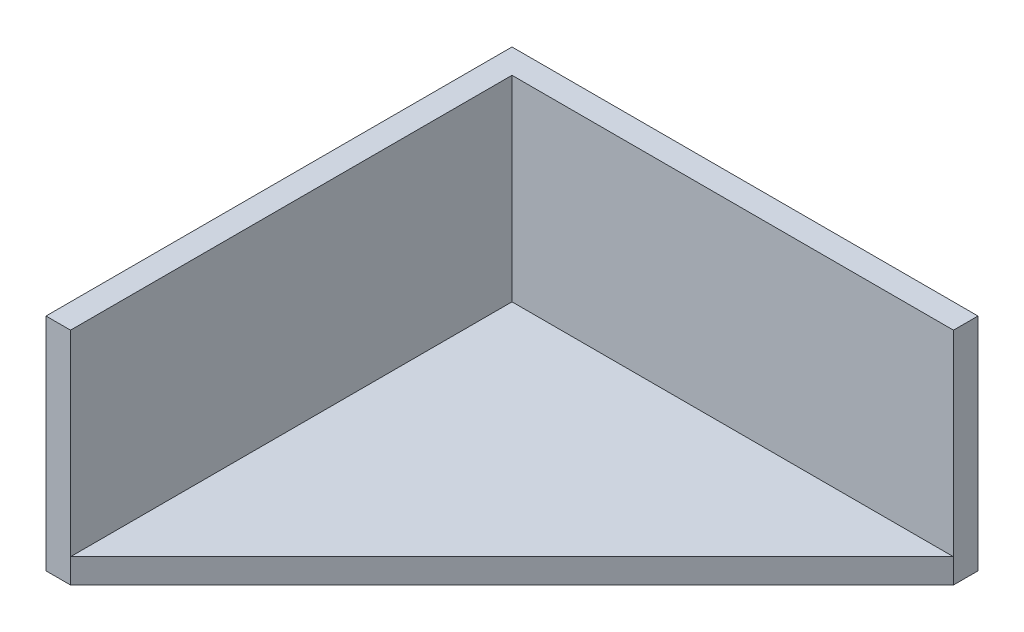
ISO-10303-21;
HEADER;
FILE_DESCRIPTION(('STEP AP214'),'2;1');
FILE_NAME('part.step','',(''),(''),'','','');
FILE_SCHEMA(('AUTOMOTIVE_DESIGN { 1 0 10303 214 1 1 1 1 }'));
ENDSEC;
DATA;
#1=APPLICATION_CONTEXT('core data for automotive mechanical design processes');
#2=APPLICATION_PROTOCOL_DEFINITION('international standard','automotive_design',2000,#1);
#3=PRODUCT_CONTEXT('',#1,'mechanical');
#4=PRODUCT('Part','Part','',(#3));
#5=PRODUCT_RELATED_PRODUCT_CATEGORY('part','',(#4));
#6=PRODUCT_DEFINITION_FORMATION('','',#4);
#7=PRODUCT_DEFINITION_CONTEXT('part definition',#1,'design');
#8=PRODUCT_DEFINITION('design','',#6,#7);
#9=PRODUCT_DEFINITION_SHAPE('','',#8);
#10=(LENGTH_UNIT() NAMED_UNIT(*) SI_UNIT(.MILLI.,.METRE.));
#11=(NAMED_UNIT(*) PLANE_ANGLE_UNIT() SI_UNIT($,.RADIAN.));
#12=(NAMED_UNIT(*) SI_UNIT($,.STERADIAN.) SOLID_ANGLE_UNIT());
#13=UNCERTAINTY_MEASURE_WITH_UNIT(LENGTH_MEASURE(1.E-05),#10,'distance_accuracy_value','');
#14=(GEOMETRIC_REPRESENTATION_CONTEXT(3) GLOBAL_UNCERTAINTY_ASSIGNED_CONTEXT((#13)) GLOBAL_UNIT_ASSIGNED_CONTEXT((#10,
#11,#12)) REPRESENTATION_CONTEXT('',''));
#15=CARTESIAN_POINT('',(0.,0.,0.));
#16=DIRECTION('',(0.,0.,1.));
#17=DIRECTION('',(1.,0.,0.));
#18=AXIS2_PLACEMENT_3D('',#15,#16,#17);
#19=CARTESIAN_POINT('',(0.,2.,0.));
#20=DIRECTION('',(0.,1.,0.));
#21=DIRECTION('',(1.,0.,0.));
#22=AXIS2_PLACEMENT_3D('',#19,#20,#21);
#23=PLANE('',#22);
#24=DIRECTION('',(-1.,0.,0.));
#25=VECTOR('',#24,1.);
#26=CARTESIAN_POINT('',(38.,2.,2.));
#27=LINE('',#26,#25);
#28=CARTESIAN_POINT('',(38.,2.,2.));
#29=VERTEX_POINT('',#28);
#30=CARTESIAN_POINT('',(2.,2.,2.));
#31=VERTEX_POINT('',#30);
#32=EDGE_CURVE('E11',#29,#31,#27,.T.);
#33=ORIENTED_EDGE('',*,*,#32,.T.);
#34=DIRECTION('',(0.,0.,1.));
#35=VECTOR('',#34,1.);
#36=CARTESIAN_POINT('',(2.,2.,2.));
#37=LINE('',#36,#35);
#38=CARTESIAN_POINT('',(2.,2.,38.));
#39=VERTEX_POINT('',#38);
#40=EDGE_CURVE('E20',#31,#39,#37,.T.);
#41=ORIENTED_EDGE('',*,*,#40,.T.);
#42=DIRECTION('',(0.707106781186548,0.,-0.707106781186548));
#43=VECTOR('',#42,1.);
#44=CARTESIAN_POINT('',(2.,2.,38.));
#45=LINE('',#44,#43);
#46=EDGE_CURVE('E142',#39,#29,#45,.T.);
#47=ORIENTED_EDGE('',*,*,#46,.T.);
#48=EDGE_LOOP('',(#33,#41,#47));
#49=FACE_BOUND('',#48,.T.);
#50=ADVANCED_FACE('F16',(#49),#23,.T.);
#51=CARTESIAN_POINT('',(38.,2.,0.));
#52=DIRECTION('',(0.,0.,1.));
#53=DIRECTION('',(1.,0.,0.));
#54=AXIS2_PLACEMENT_3D('',#51,#52,#53);
#55=PLANE('',#54);
#56=DIRECTION('',(-1.,0.,0.));
#57=VECTOR('',#56,1.);
#58=CARTESIAN_POINT('',(38.,0.,0.));
#59=LINE('',#58,#57);
#60=CARTESIAN_POINT('',(38.,0.,0.));
#61=VERTEX_POINT('',#60);
#62=CARTESIAN_POINT('',(0.,0.,0.));
#63=VERTEX_POINT('',#62);
#64=EDGE_CURVE('E139',#61,#63,#59,.T.);
#65=ORIENTED_EDGE('',*,*,#64,.T.);
#66=DIRECTION('',(0.,-1.,0.));
#67=VECTOR('',#66,1.);
#68=CARTESIAN_POINT('',(0.,2.,0.));
#69=LINE('',#68,#67);
#70=CARTESIAN_POINT('',(0.,18.,0.));
#71=VERTEX_POINT('',#70);
#72=EDGE_CURVE('E135',#71,#63,#69,.T.);
#73=ORIENTED_EDGE('',*,*,#72,.F.);
#74=DIRECTION('',(1.,0.,0.));
#75=VECTOR('',#74,1.);
#76=CARTESIAN_POINT('',(0.,18.,0.));
#77=LINE('',#76,#75);
#78=CARTESIAN_POINT('',(38.,18.,0.));
#79=VERTEX_POINT('',#78);
#80=EDGE_CURVE('E143',#71,#79,#77,.T.);
#81=ORIENTED_EDGE('',*,*,#80,.T.);
#82=DIRECTION('',(0.,-1.,0.));
#83=VECTOR('',#82,1.);
#84=CARTESIAN_POINT('',(38.,2.,0.));
#85=LINE('',#84,#83);
#86=EDGE_CURVE('E104',#79,#61,#85,.T.);
#87=ORIENTED_EDGE('',*,*,#86,.T.);
#88=EDGE_LOOP('',(#65,#73,#81,#87));
#89=FACE_BOUND('',#88,.T.);
#90=ADVANCED_FACE('F247',(#89),#55,.F.);
#91=CARTESIAN_POINT('',(0.,2.,0.));
#92=DIRECTION('',(1.,0.,0.));
#93=DIRECTION('',(0.,1.,0.));
#94=AXIS2_PLACEMENT_3D('',#91,#92,#93);
#95=PLANE('',#94);
#96=DIRECTION('',(0.,0.,1.));
#97=VECTOR('',#96,1.);
#98=CARTESIAN_POINT('',(0.,0.,0.));
#99=LINE('',#98,#97);
#100=CARTESIAN_POINT('',(0.,0.,38.));
#101=VERTEX_POINT('',#100);
#102=EDGE_CURVE('E156',#63,#101,#99,.T.);
#103=ORIENTED_EDGE('',*,*,#102,.T.);
#104=DIRECTION('',(0.,-1.,0.));
#105=VECTOR('',#104,1.);
#106=CARTESIAN_POINT('',(0.,2.,38.));
#107=LINE('',#106,#105);
#108=CARTESIAN_POINT('',(0.,18.,38.));
#109=VERTEX_POINT('',#108);
#110=EDGE_CURVE('E162',#109,#101,#107,.T.);
#111=ORIENTED_EDGE('',*,*,#110,.F.);
#112=DIRECTION('',(0.,0.,-1.));
#113=VECTOR('',#112,1.);
#114=CARTESIAN_POINT('',(0.,18.,38.));
#115=LINE('',#114,#113);
#116=EDGE_CURVE('E178',#109,#71,#115,.T.);
#117=ORIENTED_EDGE('',*,*,#116,.T.);
#118=ORIENTED_EDGE('',*,*,#72,.T.);
#119=EDGE_LOOP('',(#103,#111,#117,#118));
#120=FACE_BOUND('',#119,.T.);
#121=ADVANCED_FACE('F188',(#120),#95,.F.);
#122=CARTESIAN_POINT('',(0.,2.,38.));
#123=DIRECTION('',(0.,0.,-1.));
#124=DIRECTION('',(0.,-1.,0.));
#125=AXIS2_PLACEMENT_3D('',#122,#123,#124);
#126=PLANE('',#125);
#127=DIRECTION('',(1.,0.,0.));
#128=VECTOR('',#127,1.);
#129=CARTESIAN_POINT('',(0.,0.,38.));
#130=LINE('',#129,#128);
#131=CARTESIAN_POINT('',(2.,0.,38.));
#132=VERTEX_POINT('',#131);
#133=EDGE_CURVE('E132',#101,#132,#130,.T.);
#134=ORIENTED_EDGE('',*,*,#133,.T.);
#135=DIRECTION('',(0.,-1.,0.));
#136=VECTOR('',#135,1.);
#137=CARTESIAN_POINT('',(2.,2.,38.));
#138=LINE('',#137,#136);
#139=EDGE_CURVE('E163',#39,#132,#138,.T.);
#140=ORIENTED_EDGE('',*,*,#139,.F.);
#141=DIRECTION('',(0.,-1.,0.));
#142=VECTOR('',#141,1.);
#143=CARTESIAN_POINT('',(2.,18.,38.));
#144=LINE('',#143,#142);
#145=CARTESIAN_POINT('',(2.,18.,38.));
#146=VERTEX_POINT('',#145);
#147=EDGE_CURVE('E117',#146,#39,#144,.T.);
#148=ORIENTED_EDGE('',*,*,#147,.F.);
#149=DIRECTION('',(-1.,0.,0.));
#150=VECTOR('',#149,1.);
#151=CARTESIAN_POINT('',(2.,18.,38.));
#152=LINE('',#151,#150);
#153=EDGE_CURVE('E136',#146,#109,#152,.T.);
#154=ORIENTED_EDGE('',*,*,#153,.T.);
#155=ORIENTED_EDGE('',*,*,#110,.T.);
#156=EDGE_LOOP('',(#134,#140,#148,#154,#155));
#157=FACE_BOUND('',#156,.T.);
#158=ADVANCED_FACE('F18',(#157),#126,.F.);
#159=CARTESIAN_POINT('',(2.,2.,38.));
#160=DIRECTION('',(-0.707106781186548,0.,-0.707106781186548));
#161=DIRECTION('',(-0.707106781186548,0.,0.707106781186548));
#162=AXIS2_PLACEMENT_3D('',#159,#160,#161);
#163=PLANE('',#162);
#164=DIRECTION('',(0.707106781186548,0.,-0.707106781186548));
#165=VECTOR('',#164,1.);
#166=CARTESIAN_POINT('',(2.,0.,38.));
#167=LINE('',#166,#165);
#168=CARTESIAN_POINT('',(38.,0.,2.));
#169=VERTEX_POINT('',#168);
#170=EDGE_CURVE('E159',#132,#169,#167,.T.);
#171=ORIENTED_EDGE('',*,*,#170,.T.);
#172=DIRECTION('',(0.,-1.,0.));
#173=VECTOR('',#172,1.);
#174=CARTESIAN_POINT('',(38.,2.,2.));
#175=LINE('',#174,#173);
#176=EDGE_CURVE('E99',#29,#169,#175,.T.);
#177=ORIENTED_EDGE('',*,*,#176,.F.);
#178=ORIENTED_EDGE('',*,*,#46,.F.);
#179=ORIENTED_EDGE('',*,*,#139,.T.);
#180=EDGE_LOOP('',(#171,#177,#178,#179));
#181=FACE_BOUND('',#180,.T.);
#182=ADVANCED_FACE('F196',(#181),#163,.F.);
#183=CARTESIAN_POINT('',(38.,2.,2.));
#184=DIRECTION('',(-1.,0.,0.));
#185=DIRECTION('',(0.,0.,1.));
#186=AXIS2_PLACEMENT_3D('',#183,#184,#185);
#187=PLANE('',#186);
#188=DIRECTION('',(0.,0.,-1.));
#189=VECTOR('',#188,1.);
#190=CARTESIAN_POINT('',(38.,0.,2.));
#191=LINE('',#190,#189);
#192=EDGE_CURVE('E109',#169,#61,#191,.T.);
#193=ORIENTED_EDGE('',*,*,#192,.T.);
#194=ORIENTED_EDGE('',*,*,#86,.F.);
#195=DIRECTION('',(0.,0.,1.));
#196=VECTOR('',#195,1.);
#197=CARTESIAN_POINT('',(38.,18.,0.));
#198=LINE('',#197,#196);
#199=CARTESIAN_POINT('',(38.,18.,2.));
#200=VERTEX_POINT('',#199);
#201=EDGE_CURVE('E98',#79,#200,#198,.T.);
#202=ORIENTED_EDGE('',*,*,#201,.T.);
#203=DIRECTION('',(0.,-1.,0.));
#204=VECTOR('',#203,1.);
#205=CARTESIAN_POINT('',(38.,18.,2.));
#206=LINE('',#205,#204);
#207=EDGE_CURVE('E90',#200,#29,#206,.T.);
#208=ORIENTED_EDGE('',*,*,#207,.T.);
#209=ORIENTED_EDGE('',*,*,#176,.T.);
#210=EDGE_LOOP('',(#193,#194,#202,#208,#209));
#211=FACE_BOUND('',#210,.T.);
#212=ADVANCED_FACE('F103',(#211),#187,.F.);
#213=CARTESIAN_POINT('',(0.,0.,0.));
#214=DIRECTION('',(0.,1.,0.));
#215=DIRECTION('',(1.,0.,0.));
#216=AXIS2_PLACEMENT_3D('',#213,#214,#215);
#217=PLANE('',#216);
#218=ORIENTED_EDGE('',*,*,#64,.F.);
#219=ORIENTED_EDGE('',*,*,#192,.F.);
#220=ORIENTED_EDGE('',*,*,#170,.F.);
#221=ORIENTED_EDGE('',*,*,#133,.F.);
#222=ORIENTED_EDGE('',*,*,#102,.F.);
#223=EDGE_LOOP('',(#218,#219,#220,#221,#222));
#224=FACE_BOUND('',#223,.T.);
#225=ADVANCED_FACE('F192',(#224),#217,.F.);
#226=CARTESIAN_POINT('',(2.,18.,2.));
#227=DIRECTION('',(1.,0.,0.));
#228=DIRECTION('',(0.,0.,1.));
#229=AXIS2_PLACEMENT_3D('',#226,#227,#228);
#230=PLANE('',#229);
#231=ORIENTED_EDGE('',*,*,#40,.F.);
#232=DIRECTION('',(0.,-1.,0.));
#233=VECTOR('',#232,1.);
#234=CARTESIAN_POINT('',(2.,18.,2.));
#235=LINE('',#234,#233);
#236=CARTESIAN_POINT('',(2.,18.,2.));
#237=VERTEX_POINT('',#236);
#238=EDGE_CURVE('E118',#237,#31,#235,.T.);
#239=ORIENTED_EDGE('',*,*,#238,.F.);
#240=DIRECTION('',(0.,0.,1.));
#241=VECTOR('',#240,1.);
#242=CARTESIAN_POINT('',(2.,18.,2.));
#243=LINE('',#242,#241);
#244=EDGE_CURVE('E115',#237,#146,#243,.T.);
#245=ORIENTED_EDGE('',*,*,#244,.T.);
#246=ORIENTED_EDGE('',*,*,#147,.T.);
#247=EDGE_LOOP('',(#231,#239,#245,#246));
#248=FACE_BOUND('',#247,.T.);
#249=ADVANCED_FACE('F198',(#248),#230,.T.);
#250=CARTESIAN_POINT('',(38.,18.,2.));
#251=DIRECTION('',(0.,0.,1.));
#252=DIRECTION('',(1.,0.,0.));
#253=AXIS2_PLACEMENT_3D('',#250,#251,#252);
#254=PLANE('',#253);
#255=ORIENTED_EDGE('',*,*,#32,.F.);
#256=ORIENTED_EDGE('',*,*,#207,.F.);
#257=DIRECTION('',(-1.,0.,0.));
#258=VECTOR('',#257,1.);
#259=CARTESIAN_POINT('',(38.,18.,2.));
#260=LINE('',#259,#258);
#261=EDGE_CURVE('E95',#200,#237,#260,.T.);
#262=ORIENTED_EDGE('',*,*,#261,.T.);
#263=ORIENTED_EDGE('',*,*,#238,.T.);
#264=EDGE_LOOP('',(#255,#256,#262,#263));
#265=FACE_BOUND('',#264,.T.);
#266=ADVANCED_FACE('F92',(#265),#254,.T.);
#267=CARTESIAN_POINT('',(0.,18.,0.));
#268=DIRECTION('',(0.,-1.,0.));
#269=DIRECTION('',(0.,0.,-1.));
#270=AXIS2_PLACEMENT_3D('',#267,#268,#269);
#271=PLANE('',#270);
#272=ORIENTED_EDGE('',*,*,#244,.F.);
#273=ORIENTED_EDGE('',*,*,#261,.F.);
#274=ORIENTED_EDGE('',*,*,#201,.F.);
#275=ORIENTED_EDGE('',*,*,#80,.F.);
#276=ORIENTED_EDGE('',*,*,#116,.F.);
#277=ORIENTED_EDGE('',*,*,#153,.F.);
#278=EDGE_LOOP('',(#272,#273,#274,#275,#276,#277));
#279=FACE_BOUND('',#278,.T.);
#280=ADVANCED_FACE('F112',(#279),#271,.F.);
#281=CLOSED_SHELL('',(#50,#90,#121,#158,#182,#212,#225,#249,#266,#280));
#282=MANIFOLD_SOLID_BREP('B1',#281);
#283=ADVANCED_BREP_SHAPE_REPRESENTATION('',(#18,#282),#14);
#284=SHAPE_DEFINITION_REPRESENTATION(#9,#283);
ENDSEC;
END-ISO-10303-21;
